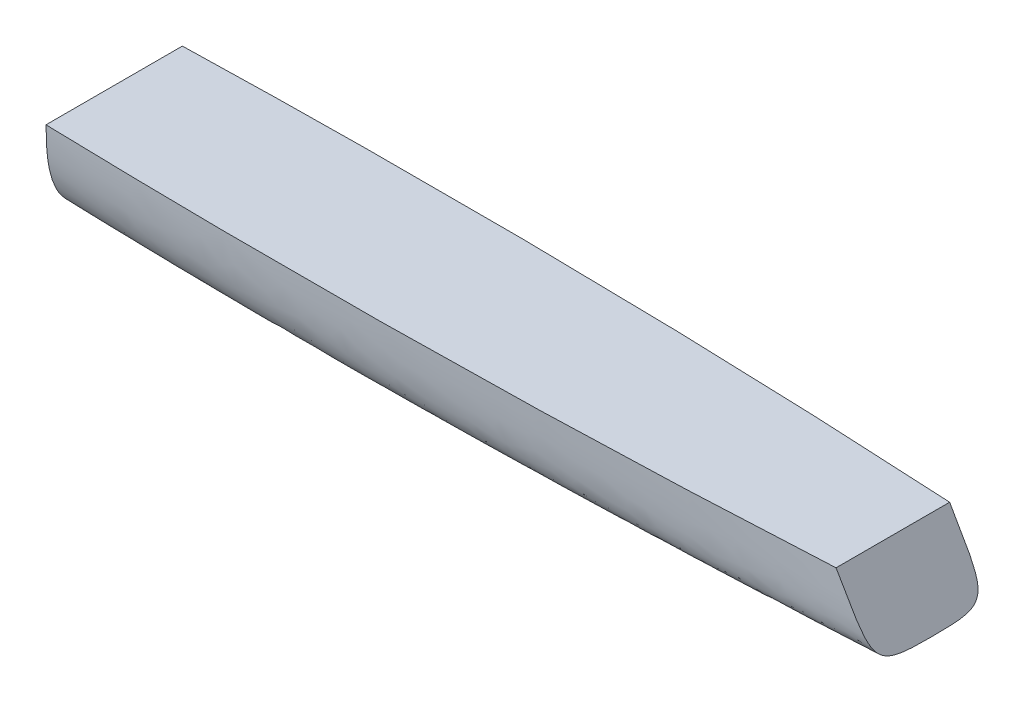
ISO-10303-21;
HEADER;
FILE_DESCRIPTION(('STEP AP214'),'2;1');
FILE_NAME('part.step','',(''),(''),'','','');
FILE_SCHEMA(('AUTOMOTIVE_DESIGN { 1 0 10303 214 1 1 1 1 }'));
ENDSEC;
DATA;
#1=APPLICATION_CONTEXT('core data for automotive mechanical design processes');
#2=APPLICATION_PROTOCOL_DEFINITION('international standard','automotive_design',2000,#1);
#3=PRODUCT_CONTEXT('',#1,'mechanical');
#4=PRODUCT('Part','Part','',(#3));
#5=PRODUCT_RELATED_PRODUCT_CATEGORY('part','',(#4));
#6=PRODUCT_DEFINITION_FORMATION('','',#4);
#7=PRODUCT_DEFINITION_CONTEXT('part definition',#1,'design');
#8=PRODUCT_DEFINITION('design','',#6,#7);
#9=PRODUCT_DEFINITION_SHAPE('','',#8);
#10=(LENGTH_UNIT() NAMED_UNIT(*) SI_UNIT(.MILLI.,.METRE.));
#11=(NAMED_UNIT(*) PLANE_ANGLE_UNIT() SI_UNIT($,.RADIAN.));
#12=(NAMED_UNIT(*) SI_UNIT($,.STERADIAN.) SOLID_ANGLE_UNIT());
#13=UNCERTAINTY_MEASURE_WITH_UNIT(LENGTH_MEASURE(1.E-05),#10,'distance_accuracy_value','');
#14=(GEOMETRIC_REPRESENTATION_CONTEXT(3) GLOBAL_UNCERTAINTY_ASSIGNED_CONTEXT((#13)) GLOBAL_UNIT_ASSIGNED_CONTEXT((#10,
#11,#12)) REPRESENTATION_CONTEXT('',''));
#15=CARTESIAN_POINT('',(0.,0.,0.));
#16=DIRECTION('',(0.,0.,1.));
#17=DIRECTION('',(1.,0.,0.));
#18=AXIS2_PLACEMENT_3D('',#15,#16,#17);
#19=CARTESIAN_POINT('',(435.202954743875,38.1,-31.75));
#20=CARTESIAN_POINT('',(289.96470358542,38.1,-40.0082514445591));
#21=CARTESIAN_POINT('',(-3.47870363388707,38.1,-44.1608103430224));
#22=CARTESIAN_POINT('',(-319.63529641458,38.1,-23.0749181112258));
#23=CARTESIAN_POINT('',(-479.197045256125,38.1,-6.35));
#24=CARTESIAN_POINT('',(456.369621410542,1.43825790645888,-31.75));
#25=CARTESIAN_POINT('',(308.744120638238,-1.38396431576335,-37.2555009630394));
#26=CARTESIAN_POINT('',(-18.3058318151969,19.9050399712793,-48.2472921755886));
#27=CARTESIAN_POINT('',(-309.322546028428,13.2807325216531,-17.4999454074839));
#28=CARTESIAN_POINT('',(-466.497045256125,16.1029547438753,-6.35));
#29=CARTESIAN_POINT('',(457.2,0.,-33.8666666666667));
#30=CARTESIAN_POINT('',(307.187249613848,-5.64444444444444,-36.6194171481864));
#31=CARTESIAN_POINT('',(-20.7324014512263,-19.7683175000991,-43.732083273171));
#32=CARTESIAN_POINT('',(-302.412750386152,-5.64444444444449,-9.80830603707528));
#33=CARTESIAN_POINT('',(-457.2,0.,-4.23333333333335));
#34=CARTESIAN_POINT('',(457.2,0.,0.));
#35=CARTESIAN_POINT('',(304.8,-8.46666666666666,0.));
#36=CARTESIAN_POINT('',(-18.3408338291158,-16.9409905000595,0.));
#37=CARTESIAN_POINT('',(-304.8,-8.46666666666668,0.));
#38=CARTESIAN_POINT('',(-457.2,0.,0.));
#39=B_SPLINE_SURFACE_WITH_KNOTS('',3,3,((#19,#20,#21,#22,#23),(#24,#25,#26,#27,#28),(#29,#30,
#31,#32,#33),(#34,#35,#36,#37,#38)),.UNSPECIFIED.,.F.,.F.,.F.,(4,4),(4,1,4),(0.,1.),(0.,
0.48497025791141,1.),.UNSPECIFIED.);
#40=CARTESIAN_POINT('',(1.59387635362577E-11,38.1,-38.1000000000008));
#41=CARTESIAN_POINT('',(5.72955891462524E-12,37.226321353687,-38.0999765086818));
#42=CARTESIAN_POINT('',(1.5367626246751E-12,36.3526100181256,-38.0949890198472));
#43=CARTESIAN_POINT('',(-1.53993615513407E-12,34.6035421586821,-38.0728431932275));
#44=CARTESIAN_POINT('',(-4.12857499480037E-13,33.7281859633354,-38.0556597429927));
#45=CARTESIAN_POINT('',(4.13336605165295E-13,31.9768432606056,-38.0068325038254));
#46=CARTESIAN_POINT('',(1.10793438461177E-13,31.1008572005879,-37.9751719573512));
#47=CARTESIAN_POINT('',(-1.10837327915929E-13,29.3492984705658,-37.894914525105));
#48=CARTESIAN_POINT('',(0.,28.473726101785,-37.8463109351793));
#49=CARTESIAN_POINT('',(0.,26.7045279866599,-37.7282077654566));
#50=CARTESIAN_POINT('',(0.,25.8109309698261,-37.6582700584362));
#51=CARTESIAN_POINT('',(0.,24.0263129374463,-37.4948064087426));
#52=CARTESIAN_POINT('',(0.,23.1352908650599,-37.4012921688014));
#53=CARTESIAN_POINT('',(0.,21.3569541348658,-37.1872264835341));
#54=CARTESIAN_POINT('',(0.,20.4696377316576,-37.0666896973985));
#55=CARTESIAN_POINT('',(0.,18.699871739935,-36.7946982795413));
#56=CARTESIAN_POINT('',(0.,17.8174212273931,-36.6432497412618));
#57=CARTESIAN_POINT('',(0.,16.2135485892853,-36.3347920541466));
#58=CARTESIAN_POINT('',(0.,15.4910447234123,-36.1834230682957));
#59=CARTESIAN_POINT('',(0.,14.0520148373611,-35.8540806895593));
#60=CARTESIAN_POINT('',(0.,13.3354893589012,-35.6761049128155));
#61=CARTESIAN_POINT('',(0.,11.9102124223037,-35.2907171573693));
#62=CARTESIAN_POINT('',(0.,11.2014624065328,-35.0832998134259));
#63=CARTESIAN_POINT('',(0.,9.79789409932042,-34.6372853586437));
#64=CARTESIAN_POINT('',(0.,9.10302206930671,-34.3988583382979));
#65=CARTESIAN_POINT('',(0.,7.72629025931103,-33.88707501798));
#66=CARTESIAN_POINT('',(0.,7.04442902300543,-33.6137226539438));
#67=CARTESIAN_POINT('',(0.,5.69718240582928,-33.0292718708644));
#68=CARTESIAN_POINT('',(0.,5.03179264719587,-32.7181836137591));
#69=CARTESIAN_POINT('',(0.,3.88041053463327,-32.1360908535973));
#70=CARTESIAN_POINT('',(0.,3.39006714392858,-31.8736783345804));
#71=CARTESIAN_POINT('',(0.,2.42301021323202,-31.3248268390383));
#72=CARTESIAN_POINT('',(0.,1.94629583246889,-31.0383893489165));
#73=CARTESIAN_POINT('',(0.,1.00858406705438,-30.4408293787405));
#74=CARTESIAN_POINT('',(0.,0.547586310796633,-30.129707482908));
#75=CARTESIAN_POINT('',(0.,-0.356192177897836,-29.4826803890986));
#76=CARTESIAN_POINT('',(0.,-0.798986157879691,-29.1467937290513));
#77=CARTESIAN_POINT('',(0.,-1.66456361199939,-28.4500741226218));
#78=CARTESIAN_POINT('',(0.,-2.08734592399821,-28.0892397304352));
#79=CARTESIAN_POINT('',(0.,-2.9107739864043,-27.3431509568606));
#80=CARTESIAN_POINT('',(0.,-3.31142065989169,-26.9578975952109));
#81=CARTESIAN_POINT('',(0.,-4.09051864866947,-26.1620624969284));
#82=CARTESIAN_POINT('',(0.,-4.46885907468903,-25.7513721384393));
#83=CARTESIAN_POINT('',(0.,-5.19977462539714,-24.9076273984455));
#84=CARTESIAN_POINT('',(0.,-5.55234820877971,-24.474571681743));
#85=CARTESIAN_POINT('',(0.,-6.2305115502425,-23.5878859603573));
#86=CARTESIAN_POINT('',(0.,-6.55610337919146,-23.1342575387864));
#87=CARTESIAN_POINT('',(0.,-7.17989437807924,-22.2079913729483));
#88=CARTESIAN_POINT('',(0.,-7.4780696432119,-21.7353375468465));
#89=CARTESIAN_POINT('',(0.,-8.04648997478124,-20.7735044475421));
#90=CARTESIAN_POINT('',(0.,-8.31673330529007,-20.284324149748));
#91=CARTESIAN_POINT('',(0.,-8.82947963688997,-19.2916455426579));
#92=CARTESIAN_POINT('',(0.,-9.07198121899133,-18.7881465026019));
#93=CARTESIAN_POINT('',(0.,-9.58654081921422,-17.6426828277292));
#94=CARTESIAN_POINT('',(0.,-9.85103867159712,-16.9973157066708));
#95=CARTESIAN_POINT('',(0.,-10.3395582076258,-15.6913348651136));
#96=CARTESIAN_POINT('',(0.,-10.5635687203218,-15.0307169932738));
#97=CARTESIAN_POINT('',(0.,-10.9733586220885,-13.6976970176145));
#98=CARTESIAN_POINT('',(0.,-11.1591333226172,-13.0252934795729));
#99=CARTESIAN_POINT('',(0.,-11.4954168892135,-11.6699143813416));
#100=CARTESIAN_POINT('',(0.,-11.6458320563939,-10.9869157328167));
#101=CARTESIAN_POINT('',(0.,-11.9134271807541,-9.61461108417581));
#102=CARTESIAN_POINT('',(0.,-12.030613185359,-8.92530625533265));
#103=CARTESIAN_POINT('',(0.,-12.2344077443895,-7.5423721377786));
#104=CARTESIAN_POINT('',(0.,-12.3210213587308,-6.84874358402732));
#105=CARTESIAN_POINT('',(0.,-12.5007336459057,-5.12838979772055));
#106=CARTESIAN_POINT('',(0.,-12.5773766723995,-4.09991715907661));
#107=CARTESIAN_POINT('',(0.,-12.6520436120708,-2.55900726478948));
#108=CARTESIAN_POINT('',(0.,-12.6702221114284,-2.04740806056589));
#109=CARTESIAN_POINT('',(0.,-12.6941963429377,-1.0238789152056));
#110=CARTESIAN_POINT('',(0.,-12.6999911707813,-0.511948952645863));
#111=CARTESIAN_POINT('',(0.,-12.7,0.));
#112=B_SPLINE_CURVE_WITH_KNOTS('',3,(#40,#41,#42,#43,#44,#45,#46,#47,#48,#49,#50,#51,#52,#53,
#54,#55,#56,#57,#58,#59,#60,#61,#62,#63,#64,#65,#66,#67,#68,#69,#70,#71,#72,#73,#74,#75,#76,#77,
#78,#79,#80,#81,#82,#83,#84,#85,#86,#87,#88,#89,#90,#91,#92,#93,#94,#95,#96,#97,#98,#99,#100,
#101,#102,#103,#104,#105,#106,#107,#108,#109,#110,#111),.UNSPECIFIED.,.F.,.F.,(4,2,2,2,2,2,2,2,
2,2,2,2,2,2,2,2,2,2,2,2,2,2,2,2,2,2,2,2,2,2,2,2,2,2,2,4),(0.,2.62107113267705,5.24755497447465,
7.87708675252731,10.5076601871762,13.1963783207727,15.8837644684278,18.5696962755038,
21.2550991319554,23.4692310291679,25.683561422459,27.8982958603115,30.1013578152933,
32.3041717133129,34.506393724718,36.1742121200127,37.8419274048954,39.5096032306664,
41.1760431321608,42.8425796905026,44.5090466999283,46.1831996036356,47.8574525690177,
49.5315769150595,51.2071473749107,52.8828219064176,54.558582110347,56.6494751055499,
58.7409441258098,60.832669453062,62.9298766688586,65.0267019654483,67.1231800618485,
70.2153152027145,71.7509682942136,73.2867335217859),.UNSPECIFIED.);
#113=CARTESIAN_POINT('',(0.,38.1,-38.1000000000008));
#114=VERTEX_POINT('',#113);
#115=CARTESIAN_POINT('',(-7.16638753697626E-10,-12.7000000000006,0.));
#116=VERTEX_POINT('',#115);
#117=EDGE_CURVE('E93',#114,#116,#112,.T.);
#118=CARTESIAN_POINT('',(435.202954743875,38.1,-31.75));
#119=CARTESIAN_POINT('',(289.96470358542,38.1,-40.0082514445591));
#120=CARTESIAN_POINT('',(-3.47870363388707,38.1,-44.1608103430224));
#121=CARTESIAN_POINT('',(-319.63529641458,38.1,-23.0749181112258));
#122=CARTESIAN_POINT('',(-479.197045256125,38.1,-6.35));
#123=B_SPLINE_CURVE_WITH_KNOTS('',3,(#118,#119,#120,#121,#122),.UNSPECIFIED.,.F.,.F.,(4,1,4),
(0.,0.48497025791141,1.),.UNSPECIFIED.);
#124=CARTESIAN_POINT('',(435.202954743875,38.1,-31.75));
#125=VERTEX_POINT('',#124);
#126=EDGE_CURVE('E62',#114,#125,#123,.F.);
#127=CARTESIAN_POINT('',(435.202954743875,38.1,-31.75));
#128=CARTESIAN_POINT('',(456.369621410542,1.43825790645888,-31.75));
#129=CARTESIAN_POINT('',(457.2,0.,-33.8666666666667));
#130=CARTESIAN_POINT('',(457.2,0.,0.));
#131=B_SPLINE_CURVE_WITH_KNOTS('',3,(#127,#128,#129,#130),.UNSPECIFIED.,.F.,.F.,(4,4),(0.,1.),.UNSPECIFIED.);
#132=CARTESIAN_POINT('',(457.2,0.,0.));
#133=VERTEX_POINT('',#132);
#134=EDGE_CURVE('E55',#133,#125,#131,.F.);
#135=CARTESIAN_POINT('',(457.2,0.,0.));
#136=CARTESIAN_POINT('',(304.8,-8.46666666666666,0.));
#137=CARTESIAN_POINT('',(-18.3408338291158,-16.9409905000595,0.));
#138=CARTESIAN_POINT('',(-304.8,-8.46666666666668,0.));
#139=CARTESIAN_POINT('',(-457.2,0.,0.));
#140=B_SPLINE_CURVE_WITH_KNOTS('',3,(#135,#136,#137,#138,#139),.UNSPECIFIED.,.F.,.F.,(4,1,4),
(0.,0.48497025791141,1.),.UNSPECIFIED.);
#141=EDGE_CURVE('E94',#116,#133,#140,.F.);
#142=ORIENTED_EDGE('',*,*,#117,.F.);
#143=ORIENTED_EDGE('',*,*,#126,.T.);
#144=ORIENTED_EDGE('',*,*,#134,.F.);
#145=ORIENTED_EDGE('',*,*,#141,.F.);
#146=EDGE_LOOP('',(#142,#143,#144,#145));
#147=FACE_BOUND('',#146,.T.);
#148=ADVANCED_FACE('F49',(#147),#39,.T.);
#149=CARTESIAN_POINT('',(342.899999999998,197.973407305124,0.));
#150=DIRECTION('',(0.866025403784436,0.500000000000004,0.));
#151=DIRECTION('',(-0.500000000000004,0.866025403784436,0.));
#152=AXIS2_PLACEMENT_3D('',#149,#150,#151);
#153=PLANE('',#152);
#154=ORIENTED_EDGE('',*,*,#134,.T.);
#155=DIRECTION('',(0.,0.,1.));
#156=VECTOR('',#155,1.);
#157=CARTESIAN_POINT('',(435.202954743875,38.1,0.));
#158=LINE('',#157,#156);
#159=CARTESIAN_POINT('',(435.202954743875,38.1,31.75));
#160=VERTEX_POINT('',#159);
#161=EDGE_CURVE('E12',#125,#160,#158,.T.);
#162=ORIENTED_EDGE('',*,*,#161,.T.);
#163=CARTESIAN_POINT('',(435.202954743875,38.1,31.75));
#164=CARTESIAN_POINT('',(456.369621410542,1.43825790645888,31.75));
#165=CARTESIAN_POINT('',(457.2,0.,33.8666666666667));
#166=CARTESIAN_POINT('',(457.2,0.,0.));
#167=B_SPLINE_CURVE_WITH_KNOTS('',3,(#163,#164,#165,#166),.UNSPECIFIED.,.F.,.F.,(4,4),(0.,1.),.UNSPECIFIED.);
#168=EDGE_CURVE('E100',#133,#160,#167,.F.);
#169=ORIENTED_EDGE('',*,*,#168,.F.);
#170=EDGE_LOOP('',(#154,#162,#169));
#171=FACE_BOUND('',#170,.T.);
#172=ADVANCED_FACE('F150',(#171),#153,.T.);
#173=CARTESIAN_POINT('',(0.,38.1,0.));
#174=DIRECTION('',(0.,-1.,0.));
#175=DIRECTION('',(0.,0.,-1.));
#176=AXIS2_PLACEMENT_3D('',#173,#174,#175);
#177=PLANE('',#176);
#178=ORIENTED_EDGE('',*,*,#126,.F.);
#179=DIRECTION('',(0.,0.,1.));
#180=VECTOR('',#179,1.);
#181=CARTESIAN_POINT('',(0.,38.1,0.));
#182=LINE('',#181,#180);
#183=CARTESIAN_POINT('',(0.,38.1,38.1000000000008));
#184=VERTEX_POINT('',#183);
#185=EDGE_CURVE('E76',#114,#184,#182,.T.);
#186=ORIENTED_EDGE('',*,*,#185,.T.);
#187=CARTESIAN_POINT('',(435.202954743875,38.1,31.75));
#188=CARTESIAN_POINT('',(289.96470358542,38.1,40.0082514445591));
#189=CARTESIAN_POINT('',(-3.47870363388707,38.1,44.1608103430224));
#190=CARTESIAN_POINT('',(-319.63529641458,38.1,23.0749181112258));
#191=CARTESIAN_POINT('',(-479.197045256125,38.1,6.35));
#192=B_SPLINE_CURVE_WITH_KNOTS('',3,(#187,#188,#189,#190,#191),.UNSPECIFIED.,.F.,.F.,(4,1,4),
(0.,0.48497025791141,1.),.UNSPECIFIED.);
#193=EDGE_CURVE('E91',#184,#160,#192,.F.);
#194=ORIENTED_EDGE('',*,*,#193,.T.);
#195=ORIENTED_EDGE('',*,*,#161,.F.);
#196=EDGE_LOOP('',(#178,#186,#194,#195));
#197=FACE_BOUND('',#196,.T.);
#198=ADVANCED_FACE('F89',(#197),#177,.F.);
#199=CARTESIAN_POINT('',(0.,0.,0.));
#200=DIRECTION('',(1.,0.,0.));
#201=DIRECTION('',(0.,0.,-1.));
#202=AXIS2_PLACEMENT_3D('',#199,#200,#201);
#203=PLANE('',#202);
#204=ORIENTED_EDGE('',*,*,#117,.T.);
#205=CARTESIAN_POINT('',(1.59387635362577E-11,38.1,38.1000000000008));
#206=CARTESIAN_POINT('',(5.72955891462524E-12,37.226321353687,38.0999765086818));
#207=CARTESIAN_POINT('',(1.5367626246751E-12,36.3526100181256,38.0949890198472));
#208=CARTESIAN_POINT('',(-1.53993615513407E-12,34.6035421586821,38.0728431932275));
#209=CARTESIAN_POINT('',(-4.12857499480037E-13,33.7281859633354,38.0556597429927));
#210=CARTESIAN_POINT('',(4.13336605165295E-13,31.9768432606056,38.0068325038254));
#211=CARTESIAN_POINT('',(1.10793438461177E-13,31.1008572005879,37.9751719573512));
#212=CARTESIAN_POINT('',(-1.10837327915929E-13,29.3492984705658,37.894914525105));
#213=CARTESIAN_POINT('',(0.,28.473726101785,37.8463109351793));
#214=CARTESIAN_POINT('',(0.,26.7045279866599,37.7282077654566));
#215=CARTESIAN_POINT('',(0.,25.8109309698261,37.6582700584362));
#216=CARTESIAN_POINT('',(0.,24.0263129374463,37.4948064087426));
#217=CARTESIAN_POINT('',(0.,23.1352908650599,37.4012921688014));
#218=CARTESIAN_POINT('',(0.,21.3569541348658,37.1872264835341));
#219=CARTESIAN_POINT('',(0.,20.4696377316576,37.0666896973985));
#220=CARTESIAN_POINT('',(0.,18.699871739935,36.7946982795413));
#221=CARTESIAN_POINT('',(0.,17.8174212273931,36.6432497412618));
#222=CARTESIAN_POINT('',(0.,16.2135485892853,36.3347920541466));
#223=CARTESIAN_POINT('',(0.,15.4910447234123,36.1834230682957));
#224=CARTESIAN_POINT('',(0.,14.0520148373611,35.8540806895593));
#225=CARTESIAN_POINT('',(0.,13.3354893589012,35.6761049128155));
#226=CARTESIAN_POINT('',(0.,11.9102124223037,35.2907171573693));
#227=CARTESIAN_POINT('',(0.,11.2014624065328,35.0832998134259));
#228=CARTESIAN_POINT('',(0.,9.79789409932042,34.6372853586437));
#229=CARTESIAN_POINT('',(0.,9.10302206930671,34.3988583382979));
#230=CARTESIAN_POINT('',(0.,7.72629025931103,33.88707501798));
#231=CARTESIAN_POINT('',(0.,7.04442902300543,33.6137226539438));
#232=CARTESIAN_POINT('',(0.,5.69718240582928,33.0292718708644));
#233=CARTESIAN_POINT('',(0.,5.03179264719587,32.7181836137591));
#234=CARTESIAN_POINT('',(0.,3.88041053463327,32.1360908535973));
#235=CARTESIAN_POINT('',(0.,3.39006714392858,31.8736783345804));
#236=CARTESIAN_POINT('',(0.,2.42301021323202,31.3248268390383));
#237=CARTESIAN_POINT('',(0.,1.94629583246889,31.0383893489165));
#238=CARTESIAN_POINT('',(0.,1.00858406705438,30.4408293787405));
#239=CARTESIAN_POINT('',(0.,0.547586310796633,30.129707482908));
#240=CARTESIAN_POINT('',(0.,-0.356192177897836,29.4826803890986));
#241=CARTESIAN_POINT('',(0.,-0.798986157879691,29.1467937290513));
#242=CARTESIAN_POINT('',(0.,-1.66456361199939,28.4500741226218));
#243=CARTESIAN_POINT('',(0.,-2.08734592399821,28.0892397304352));
#244=CARTESIAN_POINT('',(0.,-2.9107739864043,27.3431509568606));
#245=CARTESIAN_POINT('',(0.,-3.31142065989169,26.9578975952109));
#246=CARTESIAN_POINT('',(0.,-4.09051864866947,26.1620624969284));
#247=CARTESIAN_POINT('',(0.,-4.46885907468903,25.7513721384393));
#248=CARTESIAN_POINT('',(0.,-5.19977462539714,24.9076273984455));
#249=CARTESIAN_POINT('',(0.,-5.55234820877971,24.474571681743));
#250=CARTESIAN_POINT('',(0.,-6.2305115502425,23.5878859603573));
#251=CARTESIAN_POINT('',(0.,-6.55610337919146,23.1342575387864));
#252=CARTESIAN_POINT('',(0.,-7.17989437807924,22.2079913729483));
#253=CARTESIAN_POINT('',(0.,-7.4780696432119,21.7353375468465));
#254=CARTESIAN_POINT('',(0.,-8.04648997478124,20.7735044475421));
#255=CARTESIAN_POINT('',(0.,-8.31673330529007,20.284324149748));
#256=CARTESIAN_POINT('',(0.,-8.82947963688997,19.2916455426579));
#257=CARTESIAN_POINT('',(0.,-9.07198121899133,18.7881465026019));
#258=CARTESIAN_POINT('',(0.,-9.58654081921422,17.6426828277292));
#259=CARTESIAN_POINT('',(0.,-9.85103867159712,16.9973157066708));
#260=CARTESIAN_POINT('',(0.,-10.3395582076258,15.6913348651136));
#261=CARTESIAN_POINT('',(0.,-10.5635687203218,15.0307169932738));
#262=CARTESIAN_POINT('',(0.,-10.9733586220885,13.6976970176145));
#263=CARTESIAN_POINT('',(0.,-11.1591333226172,13.0252934795729));
#264=CARTESIAN_POINT('',(0.,-11.4954168892135,11.6699143813416));
#265=CARTESIAN_POINT('',(0.,-11.6458320563939,10.9869157328167));
#266=CARTESIAN_POINT('',(0.,-11.9134271807541,9.61461108417581));
#267=CARTESIAN_POINT('',(0.,-12.030613185359,8.92530625533265));
#268=CARTESIAN_POINT('',(0.,-12.2344077443895,7.5423721377786));
#269=CARTESIAN_POINT('',(0.,-12.3210213587308,6.84874358402732));
#270=CARTESIAN_POINT('',(0.,-12.5007336459057,5.12838979772055));
#271=CARTESIAN_POINT('',(0.,-12.5773766723995,4.09991715907661));
#272=CARTESIAN_POINT('',(0.,-12.6520436120708,2.55900726478948));
#273=CARTESIAN_POINT('',(0.,-12.6702221114284,2.04740806056589));
#274=CARTESIAN_POINT('',(0.,-12.6941963429377,1.0238789152056));
#275=CARTESIAN_POINT('',(0.,-12.6999911707813,0.511948952645863));
#276=CARTESIAN_POINT('',(0.,-12.7,0.));
#277=B_SPLINE_CURVE_WITH_KNOTS('',3,(#205,#206,#207,#208,#209,#210,#211,#212,#213,#214,#215,
#216,#217,#218,#219,#220,#221,#222,#223,#224,#225,#226,#227,#228,#229,#230,#231,#232,#233,#234,
#235,#236,#237,#238,#239,#240,#241,#242,#243,#244,#245,#246,#247,#248,#249,#250,#251,#252,#253,
#254,#255,#256,#257,#258,#259,#260,#261,#262,#263,#264,#265,#266,#267,#268,#269,#270,#271,#272,
#273,#274,#275,#276),.UNSPECIFIED.,.F.,.F.,(4,2,2,2,2,2,2,2,2,2,2,2,2,2,2,2,2,2,2,2,2,2,2,2,2,2,
2,2,2,2,2,2,2,2,2,4),(0.,2.62107113267705,5.24755497447465,7.87708675252731,10.5076601871762,
13.1963783207727,15.8837644684278,18.5696962755038,21.2550991319554,23.4692310291679,
25.683561422459,27.8982958603115,30.1013578152933,32.3041717133129,34.506393724718,
36.1742121200127,37.8419274048954,39.5096032306664,41.1760431321608,42.8425796905026,
44.5090466999283,46.1831996036356,47.8574525690177,49.5315769150595,51.2071473749107,
52.8828219064176,54.558582110347,56.6494751055499,58.7409441258098,60.832669453062,
62.9298766688586,65.0267019654483,67.1231800618485,70.2153152027145,71.7509682942136,
73.2867335217859),.UNSPECIFIED.);
#278=EDGE_CURVE('E99',#184,#116,#277,.T.);
#279=ORIENTED_EDGE('',*,*,#278,.F.);
#280=ORIENTED_EDGE('',*,*,#185,.F.);
#281=EDGE_LOOP('',(#204,#279,#280));
#282=FACE_BOUND('',#281,.T.);
#283=ADVANCED_FACE('F103',(#282),#203,.F.);
#284=CARTESIAN_POINT('',(435.202954743875,38.1,31.75));
#285=CARTESIAN_POINT('',(289.96470358542,38.1,40.0082514445591));
#286=CARTESIAN_POINT('',(-3.47870363388707,38.1,44.1608103430224));
#287=CARTESIAN_POINT('',(-319.63529641458,38.1,23.0749181112258));
#288=CARTESIAN_POINT('',(-479.197045256125,38.1,6.35));
#289=CARTESIAN_POINT('',(456.369621410542,1.43825790645888,31.75));
#290=CARTESIAN_POINT('',(308.744120638238,-1.38396431576335,37.2555009630394));
#291=CARTESIAN_POINT('',(-18.3058318151969,19.9050399712793,48.2472921755886));
#292=CARTESIAN_POINT('',(-309.322546028428,13.2807325216531,17.4999454074839));
#293=CARTESIAN_POINT('',(-466.497045256125,16.1029547438753,6.35));
#294=CARTESIAN_POINT('',(457.2,0.,33.8666666666667));
#295=CARTESIAN_POINT('',(307.187249613848,-5.64444444444444,36.6194171481864));
#296=CARTESIAN_POINT('',(-20.7324014512263,-19.7683175000991,43.732083273171));
#297=CARTESIAN_POINT('',(-302.412750386152,-5.64444444444449,9.80830603707528));
#298=CARTESIAN_POINT('',(-457.2,0.,4.23333333333335));
#299=CARTESIAN_POINT('',(457.2,0.,0.));
#300=CARTESIAN_POINT('',(304.8,-8.46666666666666,0.));
#301=CARTESIAN_POINT('',(-18.3408338291158,-16.9409905000595,0.));
#302=CARTESIAN_POINT('',(-304.8,-8.46666666666668,0.));
#303=CARTESIAN_POINT('',(-457.2,0.,0.));
#304=B_SPLINE_SURFACE_WITH_KNOTS('',3,3,((#284,#285,#286,#287,#288),(#289,#290,#291,#292,#293),
(#294,#295,#296,#297,#298),(#299,#300,#301,#302,#303)),.UNSPECIFIED.,.F.,.F.,.F.,(4,4),(4,1,4),
(0.,1.),(0.,0.48497025791141,1.),.UNSPECIFIED.);
#305=ORIENTED_EDGE('',*,*,#278,.T.);
#306=ORIENTED_EDGE('',*,*,#141,.T.);
#307=ORIENTED_EDGE('',*,*,#168,.T.);
#308=ORIENTED_EDGE('',*,*,#193,.F.);
#309=EDGE_LOOP('',(#305,#306,#307,#308));
#310=FACE_BOUND('',#309,.T.);
#311=ADVANCED_FACE('F97',(#310),#304,.F.);
#312=CLOSED_SHELL('',(#148,#172,#198,#283,#311));
#313=MANIFOLD_SOLID_BREP('B2',#312);
#314=ADVANCED_BREP_SHAPE_REPRESENTATION('',(#18,#313),#14);
#315=SHAPE_DEFINITION_REPRESENTATION(#9,#314);
ENDSEC;
END-ISO-10303-21;
